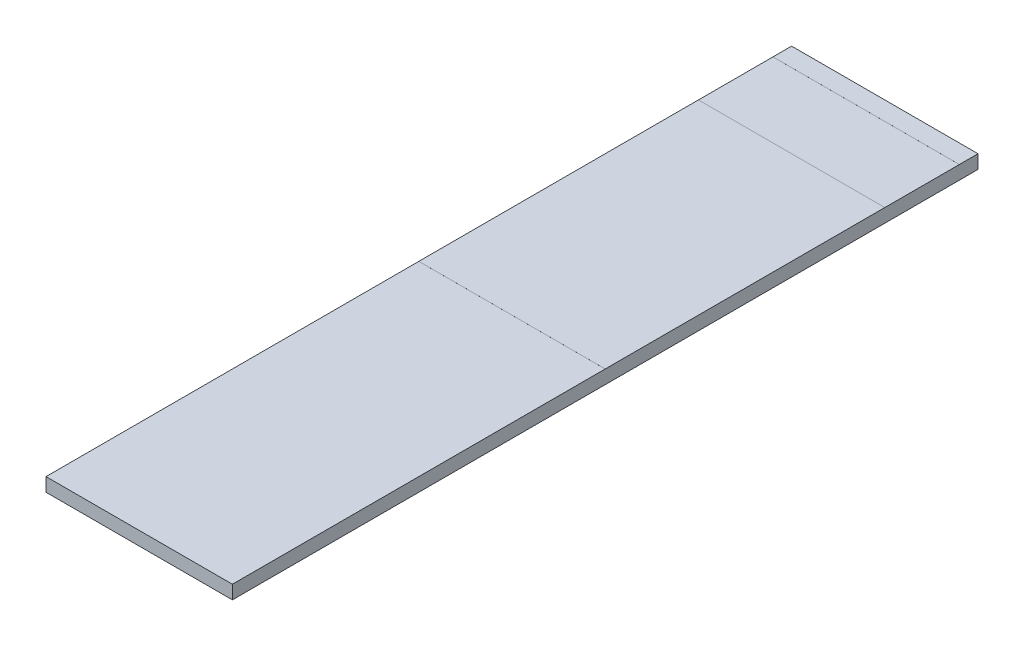
ISO-10303-21;
HEADER;
FILE_DESCRIPTION(('STEP AP214'),'2;1');
FILE_NAME('part.step','',(''),(''),'','','');
FILE_SCHEMA(('AUTOMOTIVE_DESIGN { 1 0 10303 214 1 1 1 1 }'));
ENDSEC;
DATA;
#1=APPLICATION_CONTEXT('core data for automotive mechanical design processes');
#2=APPLICATION_PROTOCOL_DEFINITION('international standard','automotive_design',2000,#1);
#3=PRODUCT_CONTEXT('',#1,'mechanical');
#4=PRODUCT('Part','Part','',(#3));
#5=PRODUCT_RELATED_PRODUCT_CATEGORY('part','',(#4));
#6=PRODUCT_DEFINITION_FORMATION('','',#4);
#7=PRODUCT_DEFINITION_CONTEXT('part definition',#1,'design');
#8=PRODUCT_DEFINITION('design','',#6,#7);
#9=PRODUCT_DEFINITION_SHAPE('','',#8);
#10=(LENGTH_UNIT() NAMED_UNIT(*) SI_UNIT(.MILLI.,.METRE.));
#11=(NAMED_UNIT(*) PLANE_ANGLE_UNIT() SI_UNIT($,.RADIAN.));
#12=(NAMED_UNIT(*) SI_UNIT($,.STERADIAN.) SOLID_ANGLE_UNIT());
#13=UNCERTAINTY_MEASURE_WITH_UNIT(LENGTH_MEASURE(1.E-05),#10,'distance_accuracy_value','');
#14=(GEOMETRIC_REPRESENTATION_CONTEXT(3) GLOBAL_UNCERTAINTY_ASSIGNED_CONTEXT((#13)) GLOBAL_UNIT_ASSIGNED_CONTEXT((#10,
#11,#12)) REPRESENTATION_CONTEXT('',''));
#15=CARTESIAN_POINT('',(0.,0.,0.));
#16=DIRECTION('',(0.,0.,1.));
#17=DIRECTION('',(1.,0.,0.));
#18=AXIS2_PLACEMENT_3D('',#15,#16,#17);
#19=CARTESIAN_POINT('',(0.,0.,4.));
#20=DIRECTION('',(0.,1.,0.));
#21=DIRECTION('',(0.,0.,1.));
#22=AXIS2_PLACEMENT_3D('',#19,#20,#21);
#23=PLANE('',#22);
#24=DIRECTION('',(0.,0.,-1.));
#25=VECTOR('',#24,1.);
#26=CARTESIAN_POINT('',(0.,0.,4.));
#27=LINE('',#26,#25);
#28=CARTESIAN_POINT('',(0.,0.,4.));
#29=VERTEX_POINT('',#28);
#30=CARTESIAN_POINT('',(0.,0.,2.));
#31=VERTEX_POINT('',#30);
#32=EDGE_CURVE('E11',#29,#31,#27,.T.);
#33=ORIENTED_EDGE('',*,*,#32,.T.);
#34=DIRECTION('',(1.,0.,0.));
#35=VECTOR('',#34,1.);
#36=CARTESIAN_POINT('',(1.,0.,2.));
#37=LINE('',#36,#35);
#38=CARTESIAN_POINT('',(1.,0.,2.));
#39=VERTEX_POINT('',#38);
#40=EDGE_CURVE('E177',#31,#39,#37,.T.);
#41=ORIENTED_EDGE('',*,*,#40,.T.);
#42=DIRECTION('',(0.,0.,-1.));
#43=VECTOR('',#42,1.);
#44=CARTESIAN_POINT('',(1.,0.,4.));
#45=LINE('',#44,#43);
#46=CARTESIAN_POINT('',(1.,0.,4.));
#47=VERTEX_POINT('',#46);
#48=EDGE_CURVE('E303',#47,#39,#45,.T.);
#49=ORIENTED_EDGE('',*,*,#48,.F.);
#50=DIRECTION('',(1.,0.,0.));
#51=VECTOR('',#50,1.);
#52=CARTESIAN_POINT('',(0.,0.,4.));
#53=LINE('',#52,#51);
#54=EDGE_CURVE('E295',#29,#47,#53,.T.);
#55=ORIENTED_EDGE('',*,*,#54,.F.);
#56=EDGE_LOOP('',(#33,#41,#49,#55));
#57=FACE_BOUND('',#56,.T.);
#58=ADVANCED_FACE('F39',(#57),#23,.F.);
#59=CARTESIAN_POINT('',(0.,0.072865,4.));
#60=DIRECTION('',(0.,1.,0.));
#61=DIRECTION('',(0.,0.,1.));
#62=AXIS2_PLACEMENT_3D('',#59,#60,#61);
#63=PLANE('',#62);
#64=DIRECTION('',(0.,0.,-1.));
#65=VECTOR('',#64,1.);
#66=CARTESIAN_POINT('',(0.,0.072865,4.));
#67=LINE('',#66,#65);
#68=CARTESIAN_POINT('',(0.,0.072865,0.5));
#69=VERTEX_POINT('',#68);
#70=CARTESIAN_POINT('',(0.,0.072865,0.1));
#71=VERTEX_POINT('',#70);
#72=EDGE_CURVE('E298',#69,#71,#67,.T.);
#73=ORIENTED_EDGE('',*,*,#72,.F.);
#74=DIRECTION('',(-1.,0.,0.));
#75=VECTOR('',#74,1.);
#76=CARTESIAN_POINT('',(1.,0.072865,0.5));
#77=LINE('',#76,#75);
#78=CARTESIAN_POINT('',(1.,0.072865,0.5));
#79=VERTEX_POINT('',#78);
#80=EDGE_CURVE('E220',#79,#69,#77,.T.);
#81=ORIENTED_EDGE('',*,*,#80,.F.);
#82=DIRECTION('',(0.,0.,-1.));
#83=VECTOR('',#82,1.);
#84=CARTESIAN_POINT('',(1.,0.072865,4.));
#85=LINE('',#84,#83);
#86=CARTESIAN_POINT('',(1.,0.072865,0.1));
#87=VERTEX_POINT('',#86);
#88=EDGE_CURVE('E308',#79,#87,#85,.T.);
#89=ORIENTED_EDGE('',*,*,#88,.T.);
#90=DIRECTION('',(1.,0.,0.));
#91=VECTOR('',#90,1.);
#92=CARTESIAN_POINT('',(1.,0.072865,0.1));
#93=LINE('',#92,#91);
#94=EDGE_CURVE('E256',#71,#87,#93,.T.);
#95=ORIENTED_EDGE('',*,*,#94,.F.);
#96=EDGE_LOOP('',(#73,#81,#89,#95));
#97=FACE_BOUND('',#96,.T.);
#98=ADVANCED_FACE('F329',(#97),#63,.T.);
#99=CARTESIAN_POINT('',(1.,0.072865,4.));
#100=VERTEX_POINT('',#99);
#101=CARTESIAN_POINT('',(1.,0.072865,2.));
#102=VERTEX_POINT('',#101);
#103=EDGE_CURVE('E305',#100,#102,#85,.T.);
#104=ORIENTED_EDGE('',*,*,#103,.T.);
#105=DIRECTION('',(1.,0.,0.));
#106=VECTOR('',#105,1.);
#107=CARTESIAN_POINT('',(1.,0.072865,2.));
#108=LINE('',#107,#106);
#109=CARTESIAN_POINT('',(0.,0.072865,2.));
#110=VERTEX_POINT('',#109);
#111=EDGE_CURVE('E229',#110,#102,#108,.T.);
#112=ORIENTED_EDGE('',*,*,#111,.F.);
#113=CARTESIAN_POINT('',(0.,0.072865,4.));
#114=VERTEX_POINT('',#113);
#115=EDGE_CURVE('E43',#114,#110,#67,.T.);
#116=ORIENTED_EDGE('',*,*,#115,.F.);
#117=DIRECTION('',(1.,0.,0.));
#118=VECTOR('',#117,1.);
#119=CARTESIAN_POINT('',(0.,0.072865,4.));
#120=LINE('',#119,#118);
#121=EDGE_CURVE('E287',#114,#100,#120,.T.);
#122=ORIENTED_EDGE('',*,*,#121,.T.);
#123=EDGE_LOOP('',(#104,#112,#116,#122));
#124=FACE_BOUND('',#123,.T.);
#125=ADVANCED_FACE('F360',(#124),#63,.T.);
#126=CARTESIAN_POINT('',(0.,0.,4.));
#127=DIRECTION('',(-1.,0.,0.));
#128=DIRECTION('',(0.,0.,1.));
#129=AXIS2_PLACEMENT_3D('',#126,#127,#128);
#130=PLANE('',#129);
#131=DIRECTION('',(0.,1.,0.));
#132=VECTOR('',#131,1.);
#133=CARTESIAN_POINT('',(0.,0.,0.));
#134=LINE('',#133,#132);
#135=CARTESIAN_POINT('',(0.,-0.0001,0.));
#136=VERTEX_POINT('',#135);
#137=CARTESIAN_POINT('',(0.,0.072965,0.));
#138=VERTEX_POINT('',#137);
#139=EDGE_CURVE('E282',#136,#138,#134,.T.);
#140=ORIENTED_EDGE('',*,*,#139,.F.);
#141=DIRECTION('',(0.,0.,1.));
#142=VECTOR('',#141,1.);
#143=CARTESIAN_POINT('',(0.,-0.0001,0.));
#144=LINE('',#143,#142);
#145=CARTESIAN_POINT('',(0.,-0.0001,0.1));
#146=VERTEX_POINT('',#145);
#147=EDGE_CURVE('E205',#136,#146,#144,.T.);
#148=ORIENTED_EDGE('',*,*,#147,.T.);
#149=DIRECTION('',(0.,1.,0.));
#150=VECTOR('',#149,1.);
#151=CARTESIAN_POINT('',(0.,-0.0001,0.1));
#152=LINE('',#151,#150);
#153=CARTESIAN_POINT('',(0.,0.,0.1));
#154=VERTEX_POINT('',#153);
#155=EDGE_CURVE('E213',#146,#154,#152,.T.);
#156=ORIENTED_EDGE('',*,*,#155,.T.);
#157=CARTESIAN_POINT('',(0.,0.,0.5));
#158=VERTEX_POINT('',#157);
#159=EDGE_CURVE('E49',#158,#154,#27,.T.);
#160=ORIENTED_EDGE('',*,*,#159,.F.);
#161=DIRECTION('',(0.,1.,0.));
#162=VECTOR('',#161,1.);
#163=CARTESIAN_POINT('',(0.,-0.0001,0.5));
#164=LINE('',#163,#162);
#165=CARTESIAN_POINT('',(0.,-0.0001,0.5));
#166=VERTEX_POINT('',#165);
#167=EDGE_CURVE('E159',#166,#158,#164,.T.);
#168=ORIENTED_EDGE('',*,*,#167,.F.);
#169=DIRECTION('',(0.,0.,1.));
#170=VECTOR('',#169,1.);
#171=CARTESIAN_POINT('',(0.,-0.0001,0.5));
#172=LINE('',#171,#170);
#173=CARTESIAN_POINT('',(0.,-0.0001,2.));
#174=VERTEX_POINT('',#173);
#175=EDGE_CURVE('E170',#166,#174,#172,.T.);
#176=ORIENTED_EDGE('',*,*,#175,.T.);
#177=DIRECTION('',(0.,1.,0.));
#178=VECTOR('',#177,1.);
#179=CARTESIAN_POINT('',(0.,-0.0001,2.));
#180=LINE('',#179,#178);
#181=EDGE_CURVE('E192',#174,#31,#180,.T.);
#182=ORIENTED_EDGE('',*,*,#181,.T.);
#183=ORIENTED_EDGE('',*,*,#32,.F.);
#184=DIRECTION('',(0.,1.,0.));
#185=VECTOR('',#184,1.);
#186=CARTESIAN_POINT('',(0.,0.,4.));
#187=LINE('',#186,#185);
#188=EDGE_CURVE('E283',#29,#114,#187,.T.);
#189=ORIENTED_EDGE('',*,*,#188,.T.);
#190=ORIENTED_EDGE('',*,*,#115,.T.);
#191=DIRECTION('',(0.,-1.,0.));
#192=VECTOR('',#191,1.);
#193=CARTESIAN_POINT('',(0.,0.072965,2.));
#194=LINE('',#193,#192);
#195=CARTESIAN_POINT('',(0.,0.072965,2.));
#196=VERTEX_POINT('',#195);
#197=EDGE_CURVE('E246',#196,#110,#194,.T.);
#198=ORIENTED_EDGE('',*,*,#197,.F.);
#199=DIRECTION('',(0.,0.,1.));
#200=VECTOR('',#199,1.);
#201=CARTESIAN_POINT('',(0.,0.072965,0.5));
#202=LINE('',#201,#200);
#203=CARTESIAN_POINT('',(0.,0.072965,0.5));
#204=VERTEX_POINT('',#203);
#205=EDGE_CURVE('E232',#204,#196,#202,.T.);
#206=ORIENTED_EDGE('',*,*,#205,.F.);
#207=DIRECTION('',(0.,-1.,0.));
#208=VECTOR('',#207,1.);
#209=CARTESIAN_POINT('',(0.,0.072965,0.5));
#210=LINE('',#209,#208);
#211=EDGE_CURVE('E249',#204,#69,#210,.T.);
#212=ORIENTED_EDGE('',*,*,#211,.T.);
#213=ORIENTED_EDGE('',*,*,#72,.T.);
#214=DIRECTION('',(0.,-1.,0.));
#215=VECTOR('',#214,1.);
#216=CARTESIAN_POINT('',(0.,0.072965,0.1));
#217=LINE('',#216,#215);
#218=CARTESIAN_POINT('',(0.,0.072965,0.1));
#219=VERTEX_POINT('',#218);
#220=EDGE_CURVE('E278',#219,#71,#217,.T.);
#221=ORIENTED_EDGE('',*,*,#220,.F.);
#222=DIRECTION('',(0.,0.,1.));
#223=VECTOR('',#222,1.);
#224=CARTESIAN_POINT('',(0.,0.072965,0.));
#225=LINE('',#224,#223);
#226=EDGE_CURVE('E265',#138,#219,#225,.T.);
#227=ORIENTED_EDGE('',*,*,#226,.F.);
#228=EDGE_LOOP('',(#140,#148,#156,#160,#168,#176,#182,#183,#189,#190,#198,#206,#212,#213,#221,#227));
#229=FACE_BOUND('',#228,.T.);
#230=ADVANCED_FACE('F41',(#229),#130,.T.);
#231=CARTESIAN_POINT('',(1.,0.,0.5));
#232=VERTEX_POINT('',#231);
#233=CARTESIAN_POINT('',(1.,0.,0.1));
#234=VERTEX_POINT('',#233);
#235=EDGE_CURVE('E64',#232,#234,#45,.T.);
#236=ORIENTED_EDGE('',*,*,#235,.F.);
#237=DIRECTION('',(-1.,0.,0.));
#238=VECTOR('',#237,1.);
#239=CARTESIAN_POINT('',(1.,0.,0.5));
#240=LINE('',#239,#238);
#241=EDGE_CURVE('E57',#232,#158,#240,.T.);
#242=ORIENTED_EDGE('',*,*,#241,.T.);
#243=ORIENTED_EDGE('',*,*,#159,.T.);
#244=DIRECTION('',(1.,0.,0.));
#245=VECTOR('',#244,1.);
#246=CARTESIAN_POINT('',(1.,0.,0.1));
#247=LINE('',#246,#245);
#248=EDGE_CURVE('E191',#154,#234,#247,.T.);
#249=ORIENTED_EDGE('',*,*,#248,.T.);
#250=EDGE_LOOP('',(#236,#242,#243,#249));
#251=FACE_BOUND('',#250,.T.);
#252=ADVANCED_FACE('F351',(#251),#23,.F.);
#253=CARTESIAN_POINT('',(1.,0.,4.));
#254=DIRECTION('',(-1.,0.,0.));
#255=DIRECTION('',(0.,0.,1.));
#256=AXIS2_PLACEMENT_3D('',#253,#254,#255);
#257=PLANE('',#256);
#258=DIRECTION('',(0.,1.,0.));
#259=VECTOR('',#258,1.);
#260=CARTESIAN_POINT('',(1.,0.,0.));
#261=LINE('',#260,#259);
#262=CARTESIAN_POINT('',(1.,-0.0001,0.));
#263=VERTEX_POINT('',#262);
#264=CARTESIAN_POINT('',(1.,0.072965,0.));
#265=VERTEX_POINT('',#264);
#266=EDGE_CURVE('E288',#263,#265,#261,.T.);
#267=ORIENTED_EDGE('',*,*,#266,.T.);
#268=DIRECTION('',(0.,0.,-1.));
#269=VECTOR('',#268,1.);
#270=CARTESIAN_POINT('',(1.,0.072965,0.));
#271=LINE('',#270,#269);
#272=CARTESIAN_POINT('',(1.,0.072965,0.1));
#273=VERTEX_POINT('',#272);
#274=EDGE_CURVE('E257',#273,#265,#271,.T.);
#275=ORIENTED_EDGE('',*,*,#274,.F.);
#276=DIRECTION('',(0.,-1.,0.));
#277=VECTOR('',#276,1.);
#278=CARTESIAN_POINT('',(1.,0.072965,0.1));
#279=LINE('',#278,#277);
#280=EDGE_CURVE('E271',#273,#87,#279,.T.);
#281=ORIENTED_EDGE('',*,*,#280,.T.);
#282=ORIENTED_EDGE('',*,*,#88,.F.);
#283=DIRECTION('',(0.,-1.,0.));
#284=VECTOR('',#283,1.);
#285=CARTESIAN_POINT('',(1.,0.072965,0.5));
#286=LINE('',#285,#284);
#287=CARTESIAN_POINT('',(1.,0.072965,0.5));
#288=VERTEX_POINT('',#287);
#289=EDGE_CURVE('E253',#288,#79,#286,.T.);
#290=ORIENTED_EDGE('',*,*,#289,.F.);
#291=DIRECTION('',(0.,0.,-1.));
#292=VECTOR('',#291,1.);
#293=CARTESIAN_POINT('',(1.,0.072965,0.5));
#294=LINE('',#293,#292);
#295=CARTESIAN_POINT('',(1.,0.072965,2.));
#296=VERTEX_POINT('',#295);
#297=EDGE_CURVE('E224',#296,#288,#294,.T.);
#298=ORIENTED_EDGE('',*,*,#297,.F.);
#299=DIRECTION('',(0.,-1.,0.));
#300=VECTOR('',#299,1.);
#301=CARTESIAN_POINT('',(1.,0.072965,2.));
#302=LINE('',#301,#300);
#303=EDGE_CURVE('E238',#296,#102,#302,.T.);
#304=ORIENTED_EDGE('',*,*,#303,.T.);
#305=ORIENTED_EDGE('',*,*,#103,.F.);
#306=DIRECTION('',(0.,1.,0.));
#307=VECTOR('',#306,1.);
#308=CARTESIAN_POINT('',(1.,0.,4.));
#309=LINE('',#308,#307);
#310=EDGE_CURVE('E292',#47,#100,#309,.T.);
#311=ORIENTED_EDGE('',*,*,#310,.F.);
#312=ORIENTED_EDGE('',*,*,#48,.T.);
#313=DIRECTION('',(0.,1.,0.));
#314=VECTOR('',#313,1.);
#315=CARTESIAN_POINT('',(1.,-0.0001,2.));
#316=LINE('',#315,#314);
#317=CARTESIAN_POINT('',(1.,-0.0001,2.));
#318=VERTEX_POINT('',#317);
#319=EDGE_CURVE('E175',#318,#39,#316,.T.);
#320=ORIENTED_EDGE('',*,*,#319,.F.);
#321=DIRECTION('',(0.,0.,-1.));
#322=VECTOR('',#321,1.);
#323=CARTESIAN_POINT('',(1.,-0.0001,0.5));
#324=LINE('',#323,#322);
#325=CARTESIAN_POINT('',(1.,-0.0001,0.5));
#326=VERTEX_POINT('',#325);
#327=EDGE_CURVE('E167',#318,#326,#324,.T.);
#328=ORIENTED_EDGE('',*,*,#327,.T.);
#329=DIRECTION('',(0.,1.,0.));
#330=VECTOR('',#329,1.);
#331=CARTESIAN_POINT('',(1.,-0.0001,0.5));
#332=LINE('',#331,#330);
#333=EDGE_CURVE('E153',#326,#232,#332,.T.);
#334=ORIENTED_EDGE('',*,*,#333,.T.);
#335=ORIENTED_EDGE('',*,*,#235,.T.);
#336=DIRECTION('',(0.,1.,0.));
#337=VECTOR('',#336,1.);
#338=CARTESIAN_POINT('',(1.,-0.0001,0.1));
#339=LINE('',#338,#337);
#340=CARTESIAN_POINT('',(1.,-0.0001,0.1));
#341=VERTEX_POINT('',#340);
#342=EDGE_CURVE('E217',#341,#234,#339,.T.);
#343=ORIENTED_EDGE('',*,*,#342,.F.);
#344=DIRECTION('',(0.,0.,-1.));
#345=VECTOR('',#344,1.);
#346=CARTESIAN_POINT('',(1.,-0.0001,0.));
#347=LINE('',#346,#345);
#348=EDGE_CURVE('E197',#341,#263,#347,.T.);
#349=ORIENTED_EDGE('',*,*,#348,.T.);
#350=EDGE_LOOP('',(#267,#275,#281,#282,#290,#298,#304,#305,#311,#312,#320,#328,#334,#335,#343,#349));
#351=FACE_BOUND('',#350,.T.);
#352=ADVANCED_FACE('F173',(#351),#257,.F.);
#353=CARTESIAN_POINT('',(0.,0.,4.));
#354=DIRECTION('',(0.,0.,-1.));
#355=DIRECTION('',(-1.,0.,0.));
#356=AXIS2_PLACEMENT_3D('',#353,#354,#355);
#357=PLANE('',#356);
#358=ORIENTED_EDGE('',*,*,#188,.F.);
#359=ORIENTED_EDGE('',*,*,#54,.T.);
#360=ORIENTED_EDGE('',*,*,#310,.T.);
#361=ORIENTED_EDGE('',*,*,#121,.F.);
#362=EDGE_LOOP('',(#358,#359,#360,#361));
#363=FACE_BOUND('',#362,.T.);
#364=ADVANCED_FACE('F358',(#363),#357,.F.);
#365=CARTESIAN_POINT('',(0.,0.,0.));
#366=DIRECTION('',(0.,0.,-1.));
#367=DIRECTION('',(-1.,0.,0.));
#368=AXIS2_PLACEMENT_3D('',#365,#366,#367);
#369=PLANE('',#368);
#370=ORIENTED_EDGE('',*,*,#139,.T.);
#371=DIRECTION('',(-1.,0.,0.));
#372=VECTOR('',#371,1.);
#373=CARTESIAN_POINT('',(1.,0.072965,0.));
#374=LINE('',#373,#372);
#375=EDGE_CURVE('E261',#265,#138,#374,.T.);
#376=ORIENTED_EDGE('',*,*,#375,.F.);
#377=ORIENTED_EDGE('',*,*,#266,.F.);
#378=DIRECTION('',(-1.,0.,0.));
#379=VECTOR('',#378,1.);
#380=CARTESIAN_POINT('',(1.,-0.0001,0.));
#381=LINE('',#380,#379);
#382=EDGE_CURVE('E201',#263,#136,#381,.T.);
#383=ORIENTED_EDGE('',*,*,#382,.T.);
#384=EDGE_LOOP('',(#370,#376,#377,#383));
#385=FACE_BOUND('',#384,.T.);
#386=ADVANCED_FACE('F344',(#385),#369,.T.);
#387=CARTESIAN_POINT('',(1.,0.072965,0.1));
#388=DIRECTION('',(0.,0.,-1.));
#389=DIRECTION('',(-1.,0.,0.));
#390=AXIS2_PLACEMENT_3D('',#387,#388,#389);
#391=PLANE('',#390);
#392=ORIENTED_EDGE('',*,*,#94,.T.);
#393=ORIENTED_EDGE('',*,*,#280,.F.);
#394=DIRECTION('',(1.,0.,0.));
#395=VECTOR('',#394,1.);
#396=CARTESIAN_POINT('',(1.,0.072965,0.1));
#397=LINE('',#396,#395);
#398=EDGE_CURVE('E268',#219,#273,#397,.T.);
#399=ORIENTED_EDGE('',*,*,#398,.F.);
#400=ORIENTED_EDGE('',*,*,#220,.T.);
#401=EDGE_LOOP('',(#392,#393,#399,#400));
#402=FACE_BOUND('',#401,.T.);
#403=ADVANCED_FACE('F332',(#402),#391,.F.);
#404=CARTESIAN_POINT('',(0.,0.072965,0.));
#405=DIRECTION('',(0.,-1.,0.));
#406=DIRECTION('',(0.,0.,-1.));
#407=AXIS2_PLACEMENT_3D('',#404,#405,#406);
#408=PLANE('',#407);
#409=ORIENTED_EDGE('',*,*,#274,.T.);
#410=ORIENTED_EDGE('',*,*,#375,.T.);
#411=ORIENTED_EDGE('',*,*,#226,.T.);
#412=ORIENTED_EDGE('',*,*,#398,.T.);
#413=EDGE_LOOP('',(#409,#410,#411,#412));
#414=FACE_BOUND('',#413,.T.);
#415=ADVANCED_FACE('F335',(#414),#408,.F.);
#416=CARTESIAN_POINT('',(1.,0.072965,0.5));
#417=DIRECTION('',(0.,0.,1.));
#418=DIRECTION('',(1.,0.,0.));
#419=AXIS2_PLACEMENT_3D('',#416,#417,#418);
#420=PLANE('',#419);
#421=ORIENTED_EDGE('',*,*,#80,.T.);
#422=ORIENTED_EDGE('',*,*,#211,.F.);
#423=DIRECTION('',(-1.,0.,0.));
#424=VECTOR('',#423,1.);
#425=CARTESIAN_POINT('',(1.,0.072965,0.5));
#426=LINE('',#425,#424);
#427=EDGE_CURVE('E228',#288,#204,#426,.T.);
#428=ORIENTED_EDGE('',*,*,#427,.F.);
#429=ORIENTED_EDGE('',*,*,#289,.T.);
#430=EDGE_LOOP('',(#421,#422,#428,#429));
#431=FACE_BOUND('',#430,.T.);
#432=ADVANCED_FACE('F392',(#431),#420,.F.);
#433=CARTESIAN_POINT('',(1.,0.072965,2.));
#434=DIRECTION('',(0.,0.,-1.));
#435=DIRECTION('',(-1.,0.,0.));
#436=AXIS2_PLACEMENT_3D('',#433,#434,#435);
#437=PLANE('',#436);
#438=ORIENTED_EDGE('',*,*,#111,.T.);
#439=ORIENTED_EDGE('',*,*,#303,.F.);
#440=DIRECTION('',(1.,0.,0.));
#441=VECTOR('',#440,1.);
#442=CARTESIAN_POINT('',(1.,0.072965,2.));
#443=LINE('',#442,#441);
#444=EDGE_CURVE('E235',#196,#296,#443,.T.);
#445=ORIENTED_EDGE('',*,*,#444,.F.);
#446=ORIENTED_EDGE('',*,*,#197,.T.);
#447=EDGE_LOOP('',(#438,#439,#445,#446));
#448=FACE_BOUND('',#447,.T.);
#449=ADVANCED_FACE('F388',(#448),#437,.F.);
#450=CARTESIAN_POINT('',(0.,0.072965,0.));
#451=DIRECTION('',(0.,-1.,0.));
#452=DIRECTION('',(0.,0.,-1.));
#453=AXIS2_PLACEMENT_3D('',#450,#451,#452);
#454=PLANE('',#453);
#455=ORIENTED_EDGE('',*,*,#297,.T.);
#456=ORIENTED_EDGE('',*,*,#427,.T.);
#457=ORIENTED_EDGE('',*,*,#205,.T.);
#458=ORIENTED_EDGE('',*,*,#444,.T.);
#459=EDGE_LOOP('',(#455,#456,#457,#458));
#460=FACE_BOUND('',#459,.T.);
#461=ADVANCED_FACE('F385',(#460),#454,.F.);
#462=CARTESIAN_POINT('',(1.,-0.0001,0.1));
#463=DIRECTION('',(0.,0.,1.));
#464=DIRECTION('',(1.,0.,0.));
#465=AXIS2_PLACEMENT_3D('',#462,#463,#464);
#466=PLANE('',#465);
#467=ORIENTED_EDGE('',*,*,#248,.F.);
#468=ORIENTED_EDGE('',*,*,#155,.F.);
#469=DIRECTION('',(1.,0.,0.));
#470=VECTOR('',#469,1.);
#471=CARTESIAN_POINT('',(1.,-0.0001,0.1));
#472=LINE('',#471,#470);
#473=EDGE_CURVE('E209',#146,#341,#472,.T.);
#474=ORIENTED_EDGE('',*,*,#473,.T.);
#475=ORIENTED_EDGE('',*,*,#342,.T.);
#476=EDGE_LOOP('',(#467,#468,#474,#475));
#477=FACE_BOUND('',#476,.T.);
#478=ADVANCED_FACE('F347',(#477),#466,.T.);
#479=CARTESIAN_POINT('',(0.,-0.0001,0.));
#480=DIRECTION('',(0.,-1.,0.));
#481=DIRECTION('',(0.,0.,-1.));
#482=AXIS2_PLACEMENT_3D('',#479,#480,#481);
#483=PLANE('',#482);
#484=ORIENTED_EDGE('',*,*,#348,.F.);
#485=ORIENTED_EDGE('',*,*,#473,.F.);
#486=ORIENTED_EDGE('',*,*,#147,.F.);
#487=ORIENTED_EDGE('',*,*,#382,.F.);
#488=EDGE_LOOP('',(#484,#485,#486,#487));
#489=FACE_BOUND('',#488,.T.);
#490=ADVANCED_FACE('F343',(#489),#483,.T.);
#491=CARTESIAN_POINT('',(1.,-0.0001,2.));
#492=DIRECTION('',(0.,0.,1.));
#493=DIRECTION('',(1.,0.,0.));
#494=AXIS2_PLACEMENT_3D('',#491,#492,#493);
#495=PLANE('',#494);
#496=ORIENTED_EDGE('',*,*,#40,.F.);
#497=ORIENTED_EDGE('',*,*,#181,.F.);
#498=DIRECTION('',(1.,0.,0.));
#499=VECTOR('',#498,1.);
#500=CARTESIAN_POINT('',(1.,-0.0001,2.));
#501=LINE('',#500,#499);
#502=EDGE_CURVE('E160',#174,#318,#501,.T.);
#503=ORIENTED_EDGE('',*,*,#502,.T.);
#504=ORIENTED_EDGE('',*,*,#319,.T.);
#505=EDGE_LOOP('',(#496,#497,#503,#504));
#506=FACE_BOUND('',#505,.T.);
#507=ADVANCED_FACE('F372',(#506),#495,.T.);
#508=CARTESIAN_POINT('',(1.,-0.0001,0.5));
#509=DIRECTION('',(0.,0.,-1.));
#510=DIRECTION('',(-1.,0.,0.));
#511=AXIS2_PLACEMENT_3D('',#508,#509,#510);
#512=PLANE('',#511);
#513=ORIENTED_EDGE('',*,*,#241,.F.);
#514=ORIENTED_EDGE('',*,*,#333,.F.);
#515=DIRECTION('',(-1.,0.,0.));
#516=VECTOR('',#515,1.);
#517=CARTESIAN_POINT('',(1.,-0.0001,0.5));
#518=LINE('',#517,#516);
#519=EDGE_CURVE('E156',#326,#166,#518,.T.);
#520=ORIENTED_EDGE('',*,*,#519,.T.);
#521=ORIENTED_EDGE('',*,*,#167,.T.);
#522=EDGE_LOOP('',(#513,#514,#520,#521));
#523=FACE_BOUND('',#522,.T.);
#524=ADVANCED_FACE('F155',(#523),#512,.T.);
#525=CARTESIAN_POINT('',(0.,-0.0001,0.));
#526=DIRECTION('',(0.,-1.,0.));
#527=DIRECTION('',(0.,0.,-1.));
#528=AXIS2_PLACEMENT_3D('',#525,#526,#527);
#529=PLANE('',#528);
#530=ORIENTED_EDGE('',*,*,#327,.F.);
#531=ORIENTED_EDGE('',*,*,#502,.F.);
#532=ORIENTED_EDGE('',*,*,#175,.F.);
#533=ORIENTED_EDGE('',*,*,#519,.F.);
#534=EDGE_LOOP('',(#530,#531,#532,#533));
#535=FACE_BOUND('',#534,.T.);
#536=ADVANCED_FACE('F165',(#535),#529,.T.);
#537=CLOSED_SHELL('',(#58,#98,#125,#230,#252,#352,#364,#386,#403,#415,#432,#449,#461,#478,#490,
#507,#524,#536));
#538=MANIFOLD_SOLID_BREP('B2',#537);
#539=ADVANCED_BREP_SHAPE_REPRESENTATION('',(#18,#538),#14);
#540=SHAPE_DEFINITION_REPRESENTATION(#9,#539);
ENDSEC;
END-ISO-10303-21;
